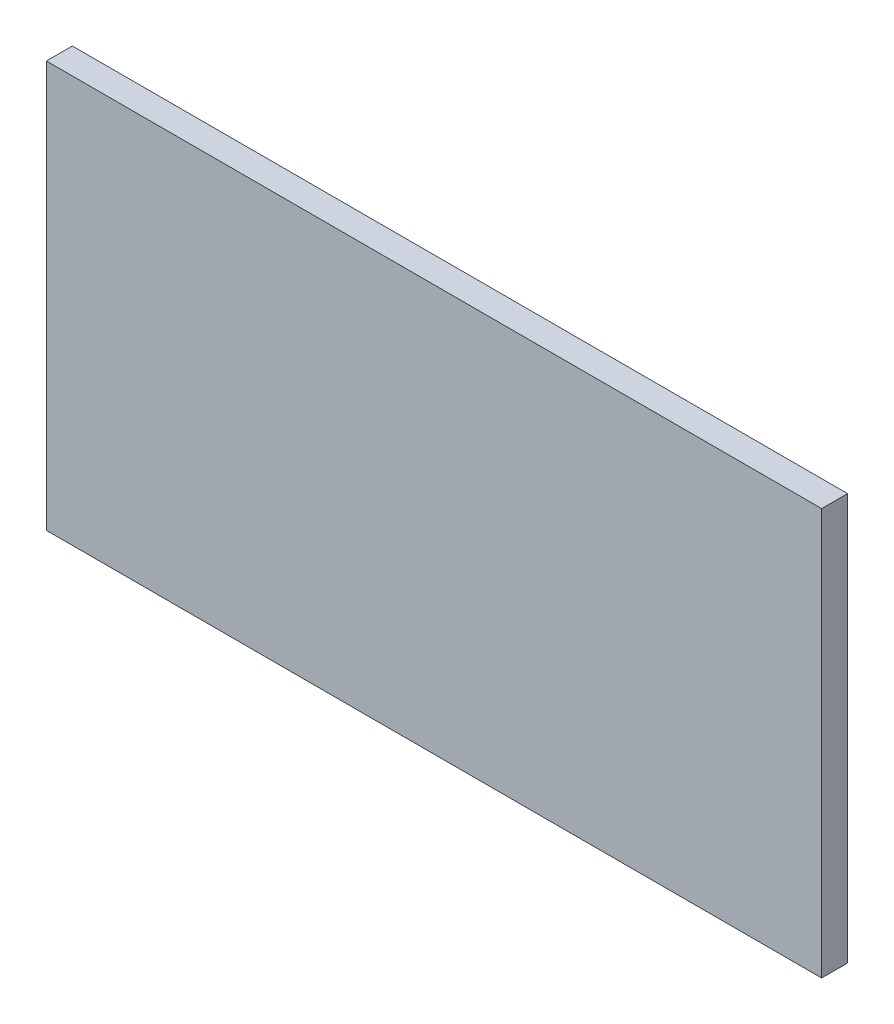
ISO-10303-21;
HEADER;
FILE_DESCRIPTION(('STEP AP214'),'2;1');
FILE_NAME('part.step','',(''),(''),'','','');
FILE_SCHEMA(('AUTOMOTIVE_DESIGN { 1 0 10303 214 1 1 1 1 }'));
ENDSEC;
DATA;
#1=APPLICATION_CONTEXT('core data for automotive mechanical design processes');
#2=APPLICATION_PROTOCOL_DEFINITION('international standard','automotive_design',2000,#1);
#3=PRODUCT_CONTEXT('',#1,'mechanical');
#4=PRODUCT('Part','Part','',(#3));
#5=PRODUCT_RELATED_PRODUCT_CATEGORY('part','',(#4));
#6=PRODUCT_DEFINITION_FORMATION('','',#4);
#7=PRODUCT_DEFINITION_CONTEXT('part definition',#1,'design');
#8=PRODUCT_DEFINITION('design','',#6,#7);
#9=PRODUCT_DEFINITION_SHAPE('','',#8);
#10=(LENGTH_UNIT() NAMED_UNIT(*) SI_UNIT(.MILLI.,.METRE.));
#11=(NAMED_UNIT(*) PLANE_ANGLE_UNIT() SI_UNIT($,.RADIAN.));
#12=(NAMED_UNIT(*) SI_UNIT($,.STERADIAN.) SOLID_ANGLE_UNIT());
#13=UNCERTAINTY_MEASURE_WITH_UNIT(LENGTH_MEASURE(1.E-05),#10,'distance_accuracy_value','');
#14=(GEOMETRIC_REPRESENTATION_CONTEXT(3) GLOBAL_UNCERTAINTY_ASSIGNED_CONTEXT((#13)) GLOBAL_UNIT_ASSIGNED_CONTEXT((#10,
#11,#12)) REPRESENTATION_CONTEXT('',''));
#15=CARTESIAN_POINT('',(0.,0.,0.));
#16=DIRECTION('',(0.,0.,1.));
#17=DIRECTION('',(1.,0.,0.));
#18=AXIS2_PLACEMENT_3D('',#15,#16,#17);
#19=CARTESIAN_POINT('',(-89.6353963357963,-46.9995608531995,-6.));
#20=DIRECTION('',(0.,-1.,0.));
#21=DIRECTION('',(0.,0.,-1.));
#22=AXIS2_PLACEMENT_3D('',#19,#20,#21);
#23=PLANE('',#22);
#24=DIRECTION('',(1.,0.,0.));
#25=VECTOR('',#24,1.);
#26=CARTESIAN_POINT('',(-89.6353963357963,-46.9995608531995,0.));
#27=LINE('',#26,#25);
#28=CARTESIAN_POINT('',(-89.6353963357963,-46.9995608531995,0.));
#29=VERTEX_POINT('',#28);
#30=CARTESIAN_POINT('',(89.6353963357963,-46.9995608531995,0.));
#31=VERTEX_POINT('',#30);
#32=EDGE_CURVE('E106',#29,#31,#27,.T.);
#33=ORIENTED_EDGE('',*,*,#32,.F.);
#34=DIRECTION('',(0.,0.,1.));
#35=VECTOR('',#34,1.);
#36=CARTESIAN_POINT('',(-89.6353963357963,-46.9995608531995,-6.));
#37=LINE('',#36,#35);
#38=CARTESIAN_POINT('',(-89.6353963357963,-46.9995608531995,-6.));
#39=VERTEX_POINT('',#38);
#40=EDGE_CURVE('E11',#39,#29,#37,.T.);
#41=ORIENTED_EDGE('',*,*,#40,.F.);
#42=DIRECTION('',(1.,0.,0.));
#43=VECTOR('',#42,1.);
#44=CARTESIAN_POINT('',(-89.6353963357963,-46.9995608531995,-6.));
#45=LINE('',#44,#43);
#46=CARTESIAN_POINT('',(89.6353963357963,-46.9995608531995,-6.));
#47=VERTEX_POINT('',#46);
#48=EDGE_CURVE('E101',#39,#47,#45,.T.);
#49=ORIENTED_EDGE('',*,*,#48,.T.);
#50=DIRECTION('',(0.,0.,1.));
#51=VECTOR('',#50,1.);
#52=CARTESIAN_POINT('',(89.6353963357963,-46.9995608531995,-6.));
#53=LINE('',#52,#51);
#54=EDGE_CURVE('E44',#47,#31,#53,.T.);
#55=ORIENTED_EDGE('',*,*,#54,.T.);
#56=EDGE_LOOP('',(#33,#41,#49,#55));
#57=FACE_BOUND('',#56,.T.);
#58=ADVANCED_FACE('F41',(#57),#23,.T.);
#59=CARTESIAN_POINT('',(-89.6353963357963,-46.9995608531995,-6.));
#60=DIRECTION('',(1.,0.,0.));
#61=DIRECTION('',(0.,0.,-1.));
#62=AXIS2_PLACEMENT_3D('',#59,#60,#61);
#63=PLANE('',#62);
#64=DIRECTION('',(0.,1.,0.));
#65=VECTOR('',#64,1.);
#66=CARTESIAN_POINT('',(-89.6353963357963,-46.9995608531995,0.));
#67=LINE('',#66,#65);
#68=CARTESIAN_POINT('',(-89.6353963357963,46.9995608531995,0.));
#69=VERTEX_POINT('',#68);
#70=EDGE_CURVE('E74',#29,#69,#67,.T.);
#71=ORIENTED_EDGE('',*,*,#70,.T.);
#72=DIRECTION('',(0.,0.,1.));
#73=VECTOR('',#72,1.);
#74=CARTESIAN_POINT('',(-89.6353963357963,46.9995608531995,-6.));
#75=LINE('',#74,#73);
#76=CARTESIAN_POINT('',(-89.6353963357963,46.9995608531995,-6.));
#77=VERTEX_POINT('',#76);
#78=EDGE_CURVE('E50',#77,#69,#75,.T.);
#79=ORIENTED_EDGE('',*,*,#78,.F.);
#80=DIRECTION('',(0.,1.,0.));
#81=VECTOR('',#80,1.);
#82=CARTESIAN_POINT('',(-89.6353963357963,-46.9995608531995,-6.));
#83=LINE('',#82,#81);
#84=EDGE_CURVE('E91',#39,#77,#83,.T.);
#85=ORIENTED_EDGE('',*,*,#84,.F.);
#86=ORIENTED_EDGE('',*,*,#40,.T.);
#87=EDGE_LOOP('',(#71,#79,#85,#86));
#88=FACE_BOUND('',#87,.T.);
#89=ADVANCED_FACE('F116',(#88),#63,.F.);
#90=CARTESIAN_POINT('',(-89.6353963357963,46.9995608531995,-6.));
#91=DIRECTION('',(0.,-1.,0.));
#92=DIRECTION('',(0.,0.,-1.));
#93=AXIS2_PLACEMENT_3D('',#90,#91,#92);
#94=PLANE('',#93);
#95=DIRECTION('',(1.,0.,0.));
#96=VECTOR('',#95,1.);
#97=CARTESIAN_POINT('',(-89.6353963357963,46.9995608531995,0.));
#98=LINE('',#97,#96);
#99=CARTESIAN_POINT('',(89.6353963357963,46.9995608531995,0.));
#100=VERTEX_POINT('',#99);
#101=EDGE_CURVE('E98',#69,#100,#98,.T.);
#102=ORIENTED_EDGE('',*,*,#101,.T.);
#103=DIRECTION('',(0.,0.,1.));
#104=VECTOR('',#103,1.);
#105=CARTESIAN_POINT('',(89.6353963357963,46.9995608531995,-6.));
#106=LINE('',#105,#104);
#107=CARTESIAN_POINT('',(89.6353963357963,46.9995608531995,-6.));
#108=VERTEX_POINT('',#107);
#109=EDGE_CURVE('E95',#108,#100,#106,.T.);
#110=ORIENTED_EDGE('',*,*,#109,.F.);
#111=DIRECTION('',(1.,0.,0.));
#112=VECTOR('',#111,1.);
#113=CARTESIAN_POINT('',(-89.6353963357963,46.9995608531995,-6.));
#114=LINE('',#113,#112);
#115=EDGE_CURVE('E86',#77,#108,#114,.T.);
#116=ORIENTED_EDGE('',*,*,#115,.F.);
#117=ORIENTED_EDGE('',*,*,#78,.T.);
#118=EDGE_LOOP('',(#102,#110,#116,#117));
#119=FACE_BOUND('',#118,.T.);
#120=ADVANCED_FACE('F96',(#119),#94,.F.);
#121=CARTESIAN_POINT('',(89.6353963357963,-46.9995608531995,-6.));
#122=DIRECTION('',(1.,0.,0.));
#123=DIRECTION('',(0.,0.,-1.));
#124=AXIS2_PLACEMENT_3D('',#121,#122,#123);
#125=PLANE('',#124);
#126=DIRECTION('',(0.,1.,0.));
#127=VECTOR('',#126,1.);
#128=CARTESIAN_POINT('',(89.6353963357963,-46.9995608531995,0.));
#129=LINE('',#128,#127);
#130=EDGE_CURVE('E109',#31,#100,#129,.T.);
#131=ORIENTED_EDGE('',*,*,#130,.F.);
#132=ORIENTED_EDGE('',*,*,#54,.F.);
#133=DIRECTION('',(0.,1.,0.));
#134=VECTOR('',#133,1.);
#135=CARTESIAN_POINT('',(89.6353963357963,-46.9995608531995,-6.));
#136=LINE('',#135,#134);
#137=EDGE_CURVE('E90',#47,#108,#136,.T.);
#138=ORIENTED_EDGE('',*,*,#137,.T.);
#139=ORIENTED_EDGE('',*,*,#109,.T.);
#140=EDGE_LOOP('',(#131,#132,#138,#139));
#141=FACE_BOUND('',#140,.T.);
#142=ADVANCED_FACE('F100',(#141),#125,.T.);
#143=CARTESIAN_POINT('',(0.,0.,-6.));
#144=DIRECTION('',(0.,0.,1.));
#145=DIRECTION('',(1.,0.,0.));
#146=AXIS2_PLACEMENT_3D('',#143,#144,#145);
#147=PLANE('',#146);
#148=ORIENTED_EDGE('',*,*,#48,.F.);
#149=ORIENTED_EDGE('',*,*,#84,.T.);
#150=ORIENTED_EDGE('',*,*,#115,.T.);
#151=ORIENTED_EDGE('',*,*,#137,.F.);
#152=EDGE_LOOP('',(#148,#149,#150,#151));
#153=FACE_BOUND('',#152,.T.);
#154=ADVANCED_FACE('F89',(#153),#147,.F.);
#155=CARTESIAN_POINT('',(0.,0.,0.));
#156=DIRECTION('',(0.,0.,1.));
#157=DIRECTION('',(1.,0.,0.));
#158=AXIS2_PLACEMENT_3D('',#155,#156,#157);
#159=PLANE('',#158);
#160=ORIENTED_EDGE('',*,*,#32,.T.);
#161=ORIENTED_EDGE('',*,*,#130,.T.);
#162=ORIENTED_EDGE('',*,*,#101,.F.);
#163=ORIENTED_EDGE('',*,*,#70,.F.);
#164=EDGE_LOOP('',(#160,#161,#162,#163));
#165=FACE_BOUND('',#164,.T.);
#166=ADVANCED_FACE('F114',(#165),#159,.T.);
#167=CLOSED_SHELL('',(#58,#89,#120,#142,#154,#166));
#168=MANIFOLD_SOLID_BREP('B2',#167);
#169=ADVANCED_BREP_SHAPE_REPRESENTATION('',(#18,#168),#14);
#170=SHAPE_DEFINITION_REPRESENTATION(#9,#169);
ENDSEC;
END-ISO-10303-21;
